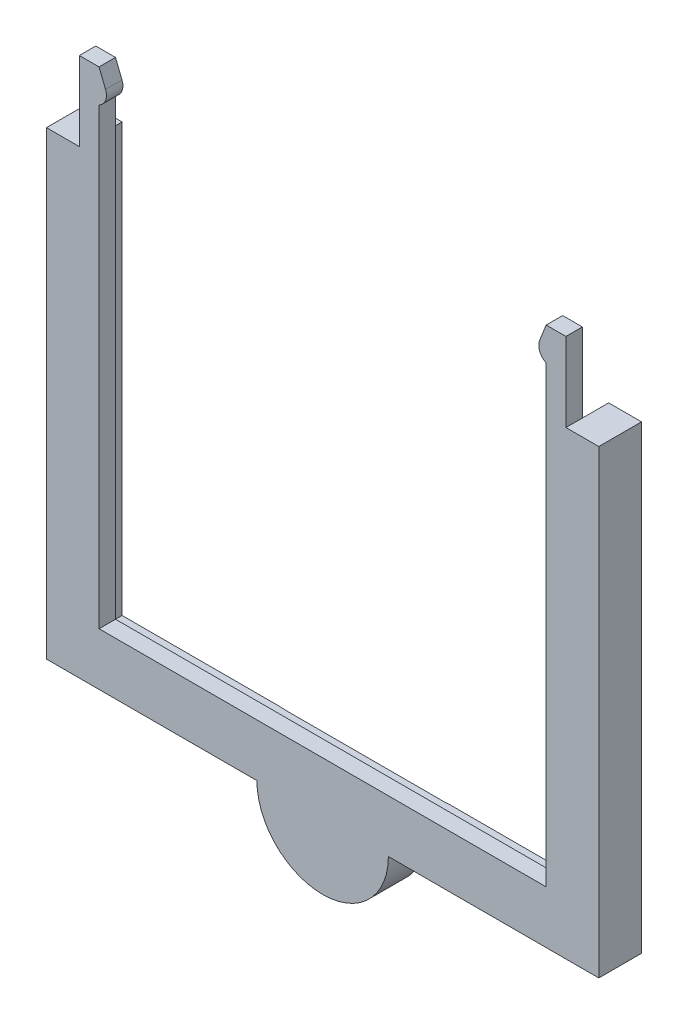
ISO-10303-21;
HEADER;
FILE_DESCRIPTION(('STEP AP214'),'2;1');
FILE_NAME('part.step','',(''),(''),'','','');
FILE_SCHEMA(('AUTOMOTIVE_DESIGN { 1 0 10303 214 1 1 1 1 }'));
ENDSEC;
DATA;
#1=APPLICATION_CONTEXT('core data for automotive mechanical design processes');
#2=APPLICATION_PROTOCOL_DEFINITION('international standard','automotive_design',2000,#1);
#3=PRODUCT_CONTEXT('',#1,'mechanical');
#4=PRODUCT('Part','Part','',(#3));
#5=PRODUCT_RELATED_PRODUCT_CATEGORY('part','',(#4));
#6=PRODUCT_DEFINITION_FORMATION('','',#4);
#7=PRODUCT_DEFINITION_CONTEXT('part definition',#1,'design');
#8=PRODUCT_DEFINITION('design','',#6,#7);
#9=PRODUCT_DEFINITION_SHAPE('','',#8);
#10=(LENGTH_UNIT() NAMED_UNIT(*) SI_UNIT(.MILLI.,.METRE.));
#11=(NAMED_UNIT(*) PLANE_ANGLE_UNIT() SI_UNIT($,.RADIAN.));
#12=(NAMED_UNIT(*) SI_UNIT($,.STERADIAN.) SOLID_ANGLE_UNIT());
#13=UNCERTAINTY_MEASURE_WITH_UNIT(LENGTH_MEASURE(1.E-05),#10,'distance_accuracy_value','');
#14=(GEOMETRIC_REPRESENTATION_CONTEXT(3) GLOBAL_UNCERTAINTY_ASSIGNED_CONTEXT((#13)) GLOBAL_UNIT_ASSIGNED_CONTEXT((#10,
#11,#12)) REPRESENTATION_CONTEXT('',''));
#15=CARTESIAN_POINT('',(0.,0.,0.));
#16=DIRECTION('',(0.,0.,1.));
#17=DIRECTION('',(1.,0.,0.));
#18=AXIS2_PLACEMENT_3D('',#15,#16,#17);
#19=CARTESIAN_POINT('',(-42.,0.,-4.));
#20=DIRECTION('',(0.,0.,-1.));
#21=DIRECTION('',(-1.,0.,0.));
#22=AXIS2_PLACEMENT_3D('',#19,#20,#21);
#23=PLANE('',#22);
#24=DIRECTION('',(1.,0.,0.));
#25=VECTOR('',#24,1.);
#26=CARTESIAN_POINT('',(-79.,5.,-4.));
#27=LINE('',#26,#25);
#28=CARTESIAN_POINT('',(-79.,5.,-4.));
#29=VERTEX_POINT('',#28);
#30=CARTESIAN_POINT('',(-55.076696830622,5.,-4.));
#31=VERTEX_POINT('',#30);
#32=EDGE_CURVE('E244',#29,#31,#27,.T.);
#33=ORIENTED_EDGE('',*,*,#32,.T.);
#34=CARTESIAN_POINT('',(-42.,0.,-4.));
#35=DIRECTION('',(0.,0.,-1.));
#36=DIRECTION('',(-1.,0.,0.));
#37=AXIS2_PLACEMENT_3D('',#34,#35,#36);
#38=CIRCLE('',#37,14.);
#39=CARTESIAN_POINT('',(-56.,0.,-4.));
#40=VERTEX_POINT('',#39);
#41=EDGE_CURVE('E483',#31,#40,#38,.F.);
#42=ORIENTED_EDGE('',*,*,#41,.T.);
#43=DIRECTION('',(-1.,0.,0.));
#44=VECTOR('',#43,1.);
#45=CARTESIAN_POINT('',(0.,0.,-4.));
#46=LINE('',#45,#44);
#47=CARTESIAN_POINT('',(-84.,0.,-4.));
#48=VERTEX_POINT('',#47);
#49=EDGE_CURVE('E231',#40,#48,#46,.T.);
#50=ORIENTED_EDGE('',*,*,#49,.T.);
#51=DIRECTION('',(0.,1.,0.));
#52=VECTOR('',#51,1.);
#53=CARTESIAN_POINT('',(-84.,0.,-4.));
#54=LINE('',#53,#52);
#55=CARTESIAN_POINT('',(-84.,70.,-4.));
#56=VERTEX_POINT('',#55);
#57=EDGE_CURVE('E236',#48,#56,#54,.T.);
#58=ORIENTED_EDGE('',*,*,#57,.T.);
#59=DIRECTION('',(1.,0.,0.));
#60=VECTOR('',#59,1.);
#61=CARTESIAN_POINT('',(-84.,70.,-4.));
#62=LINE('',#61,#60);
#63=CARTESIAN_POINT('',(-79.,70.,-4.));
#64=VERTEX_POINT('',#63);
#65=EDGE_CURVE('E239',#56,#64,#62,.T.);
#66=ORIENTED_EDGE('',*,*,#65,.T.);
#67=DIRECTION('',(0.,-1.,0.));
#68=VECTOR('',#67,1.);
#69=CARTESIAN_POINT('',(-79.,70.,-4.));
#70=LINE('',#69,#68);
#71=EDGE_CURVE('E241',#64,#29,#70,.T.);
#72=ORIENTED_EDGE('',*,*,#71,.T.);
#73=EDGE_LOOP('',(#33,#42,#50,#58,#66,#72));
#74=FACE_BOUND('',#73,.T.);
#75=ADVANCED_FACE('F33',(#74),#23,.T.);
#76=CARTESIAN_POINT('',(0.,0.,0.));
#77=DIRECTION('',(0.,0.,1.));
#78=DIRECTION('',(1.,0.,0.));
#79=AXIS2_PLACEMENT_3D('',#76,#77,#78);
#80=PLANE('',#79);
#81=DIRECTION('',(0.,-1.,0.));
#82=VECTOR('',#81,1.);
#83=CARTESIAN_POINT('',(-8.,7.99999999999999,0.));
#84=LINE('',#83,#82);
#85=CARTESIAN_POINT('',(-8.,77.,0.));
#86=VERTEX_POINT('',#85);
#87=CARTESIAN_POINT('',(-8.,7.99999999999999,0.));
#88=VERTEX_POINT('',#87);
#89=EDGE_CURVE('E325',#86,#88,#84,.T.);
#90=ORIENTED_EDGE('',*,*,#89,.F.);
#91=CARTESIAN_POINT('',(-7.12630551264708,78.7990714112478,0.));
#92=DIRECTION('',(0.,0.,1.));
#93=DIRECTION('',(1.,0.,0.));
#94=AXIS2_PLACEMENT_3D('',#91,#92,#93);
#95=CIRCLE('',#94,2.);
#96=CARTESIAN_POINT('',(-8.9832588944176,79.541852763956,0.));
#97=VERTEX_POINT('',#96);
#98=EDGE_CURVE('E529',#86,#97,#95,.F.);
#99=ORIENTED_EDGE('',*,*,#98,.T.);
#100=DIRECTION('',(0.371390676354103,0.928476690885259,0.));
#101=VECTOR('',#100,1.);
#102=CARTESIAN_POINT('',(-8.,82.,0.));
#103=LINE('',#102,#101);
#104=CARTESIAN_POINT('',(-8.,82.,0.));
#105=VERTEX_POINT('',#104);
#106=EDGE_CURVE('E280',#97,#105,#103,.T.);
#107=ORIENTED_EDGE('',*,*,#106,.T.);
#108=DIRECTION('',(-1.,0.,0.));
#109=VECTOR('',#108,1.);
#110=CARTESIAN_POINT('',(-8.,82.,0.));
#111=LINE('',#110,#109);
#112=CARTESIAN_POINT('',(-5.,82.,0.));
#113=VERTEX_POINT('',#112);
#114=EDGE_CURVE('E314',#113,#105,#111,.T.);
#115=ORIENTED_EDGE('',*,*,#114,.F.);
#116=DIRECTION('',(0.,-1.,0.));
#117=VECTOR('',#116,1.);
#118=CARTESIAN_POINT('',(-5.,82.,0.));
#119=LINE('',#118,#117);
#120=CARTESIAN_POINT('',(-5.,70.,0.));
#121=VERTEX_POINT('',#120);
#122=EDGE_CURVE('E317',#113,#121,#119,.T.);
#123=ORIENTED_EDGE('',*,*,#122,.T.);
#124=DIRECTION('',(0.,1.,0.));
#125=VECTOR('',#124,1.);
#126=CARTESIAN_POINT('',(-5.,4.99999999999999,0.));
#127=LINE('',#126,#125);
#128=CARTESIAN_POINT('',(-5.,4.99999999999999,0.));
#129=VERTEX_POINT('',#128);
#130=EDGE_CURVE('E232',#129,#121,#127,.T.);
#131=ORIENTED_EDGE('',*,*,#130,.F.);
#132=DIRECTION('',(1.,0.,0.));
#133=VECTOR('',#132,1.);
#134=CARTESIAN_POINT('',(-79.,5.,0.));
#135=LINE('',#134,#133);
#136=CARTESIAN_POINT('',(-79.,5.,0.));
#137=VERTEX_POINT('',#136);
#138=EDGE_CURVE('E225',#137,#129,#135,.T.);
#139=ORIENTED_EDGE('',*,*,#138,.F.);
#140=DIRECTION('',(0.,-1.,0.));
#141=VECTOR('',#140,1.);
#142=CARTESIAN_POINT('',(-79.,70.,0.));
#143=LINE('',#142,#141);
#144=CARTESIAN_POINT('',(-79.,70.,0.));
#145=VERTEX_POINT('',#144);
#146=EDGE_CURVE('E223',#145,#137,#143,.T.);
#147=ORIENTED_EDGE('',*,*,#146,.F.);
#148=DIRECTION('',(0.,-1.,0.));
#149=VECTOR('',#148,1.);
#150=CARTESIAN_POINT('',(-79.,82.,0.));
#151=LINE('',#150,#149);
#152=CARTESIAN_POINT('',(-79.,82.,0.));
#153=VERTEX_POINT('',#152);
#154=EDGE_CURVE('E303',#153,#145,#151,.T.);
#155=ORIENTED_EDGE('',*,*,#154,.F.);
#156=DIRECTION('',(-1.,0.,0.));
#157=VECTOR('',#156,1.);
#158=CARTESIAN_POINT('',(-76.,82.,0.));
#159=LINE('',#158,#157);
#160=CARTESIAN_POINT('',(-76.,82.,0.));
#161=VERTEX_POINT('',#160);
#162=EDGE_CURVE('E291',#161,#153,#159,.T.);
#163=ORIENTED_EDGE('',*,*,#162,.F.);
#164=DIRECTION('',(0.371390676354108,-0.928476690885258,0.));
#165=VECTOR('',#164,1.);
#166=CARTESIAN_POINT('',(-74.,77.,0.));
#167=LINE('',#166,#165);
#168=CARTESIAN_POINT('',(-75.0167411055824,79.541852763956,0.));
#169=VERTEX_POINT('',#168);
#170=EDGE_CURVE('E272',#161,#169,#167,.T.);
#171=ORIENTED_EDGE('',*,*,#170,.T.);
#172=CARTESIAN_POINT('',(-76.8736944873529,78.7990714112478,0.));
#173=DIRECTION('',(0.,0.,1.));
#174=DIRECTION('',(1.,0.,0.));
#175=AXIS2_PLACEMENT_3D('',#172,#173,#174);
#176=CIRCLE('',#175,2.);
#177=CARTESIAN_POINT('',(-76.,77.,0.));
#178=VERTEX_POINT('',#177);
#179=EDGE_CURVE('E528',#169,#178,#176,.F.);
#180=ORIENTED_EDGE('',*,*,#179,.T.);
#181=DIRECTION('',(0.,1.,0.));
#182=VECTOR('',#181,1.);
#183=CARTESIAN_POINT('',(-76.,70.,0.));
#184=LINE('',#183,#182);
#185=CARTESIAN_POINT('',(-76.,7.99999999999999,0.));
#186=VERTEX_POINT('',#185);
#187=EDGE_CURVE('E330',#186,#178,#184,.T.);
#188=ORIENTED_EDGE('',*,*,#187,.F.);
#189=DIRECTION('',(-1.,0.,0.));
#190=VECTOR('',#189,1.);
#191=CARTESIAN_POINT('',(-76.,7.99999999999999,0.));
#192=LINE('',#191,#190);
#193=EDGE_CURVE('E349',#88,#186,#192,.T.);
#194=ORIENTED_EDGE('',*,*,#193,.F.);
#195=EDGE_LOOP('',(#90,#99,#107,#115,#123,#131,#139,#147,#155,#163,#171,#180,#188,#194));
#196=FACE_BOUND('',#195,.T.);
#197=ADVANCED_FACE('F431',(#196),#80,.F.);
#198=CARTESIAN_POINT('',(0.,0.,2.5));
#199=DIRECTION('',(0.,1.,0.));
#200=DIRECTION('',(-1.,0.,0.));
#201=AXIS2_PLACEMENT_3D('',#198,#199,#200);
#202=PLANE('',#201);
#203=ORIENTED_EDGE('',*,*,#49,.F.);
#204=CARTESIAN_POINT('',(-56.,0.,6.));
#205=DIRECTION('',(0.,1.,0.));
#206=DIRECTION('',(-1.,0.,0.));
#207=AXIS2_PLACEMENT_3D('',#204,#205,#206);
#208=CIRCLE('',#207,10.);
#209=CARTESIAN_POINT('',(-52.,0.,-3.16515138991168));
#210=VERTEX_POINT('',#209);
#211=EDGE_CURVE('E481',#40,#210,#208,.F.);
#212=ORIENTED_EDGE('',*,*,#211,.T.);
#213=DIRECTION('',(0.,0.,1.));
#214=VECTOR('',#213,1.);
#215=CARTESIAN_POINT('',(-52.,0.,-4.));
#216=LINE('',#215,#214);
#217=CARTESIAN_POINT('',(-52.,0.,2.5));
#218=VERTEX_POINT('',#217);
#219=EDGE_CURVE('E270',#210,#218,#216,.T.);
#220=ORIENTED_EDGE('',*,*,#219,.T.);
#221=DIRECTION('',(1.,0.,0.));
#222=VECTOR('',#221,1.);
#223=CARTESIAN_POINT('',(0.,0.,2.5));
#224=LINE('',#223,#222);
#225=CARTESIAN_POINT('',(-84.,0.,2.5));
#226=VERTEX_POINT('',#225);
#227=EDGE_CURVE('E344',#226,#218,#224,.T.);
#228=ORIENTED_EDGE('',*,*,#227,.F.);
#229=DIRECTION('',(0.,0.,-1.));
#230=VECTOR('',#229,1.);
#231=CARTESIAN_POINT('',(-84.,0.,2.5));
#232=LINE('',#231,#230);
#233=EDGE_CURVE('E354',#226,#48,#232,.T.);
#234=ORIENTED_EDGE('',*,*,#233,.T.);
#235=EDGE_LOOP('',(#203,#212,#220,#228,#234));
#236=FACE_BOUND('',#235,.T.);
#237=ADVANCED_FACE('F434',(#236),#202,.F.);
#238=DIRECTION('',(0.,0.,1.));
#239=VECTOR('',#238,1.);
#240=CARTESIAN_POINT('',(-32.,0.,-4.));
#241=LINE('',#240,#239);
#242=CARTESIAN_POINT('',(-32.,0.,-3.16515138991168));
#243=VERTEX_POINT('',#242);
#244=CARTESIAN_POINT('',(-32.,0.,2.5));
#245=VERTEX_POINT('',#244);
#246=EDGE_CURVE('E268',#243,#245,#241,.T.);
#247=ORIENTED_EDGE('',*,*,#246,.F.);
#248=CARTESIAN_POINT('',(-28.,0.,6.));
#249=DIRECTION('',(0.,1.,0.));
#250=DIRECTION('',(-1.,0.,0.));
#251=AXIS2_PLACEMENT_3D('',#248,#249,#250);
#252=CIRCLE('',#251,10.);
#253=CARTESIAN_POINT('',(-28.,0.,-4.));
#254=VERTEX_POINT('',#253);
#255=EDGE_CURVE('E215',#243,#254,#252,.F.);
#256=ORIENTED_EDGE('',*,*,#255,.T.);
#257=CARTESIAN_POINT('',(0.,0.,-4.));
#258=VERTEX_POINT('',#257);
#259=EDGE_CURVE('E233',#258,#254,#46,.T.);
#260=ORIENTED_EDGE('',*,*,#259,.F.);
#261=DIRECTION('',(0.,0.,-1.));
#262=VECTOR('',#261,1.);
#263=CARTESIAN_POINT('',(0.,0.,2.5));
#264=LINE('',#263,#262);
#265=CARTESIAN_POINT('',(0.,0.,2.5));
#266=VERTEX_POINT('',#265);
#267=EDGE_CURVE('E347',#266,#258,#264,.T.);
#268=ORIENTED_EDGE('',*,*,#267,.F.);
#269=EDGE_CURVE('E343',#245,#266,#224,.T.);
#270=ORIENTED_EDGE('',*,*,#269,.F.);
#271=EDGE_LOOP('',(#247,#256,#260,#268,#270));
#272=FACE_BOUND('',#271,.T.);
#273=ADVANCED_FACE('F438',(#272),#202,.F.);
#274=CARTESIAN_POINT('',(-76.,70.,2.5));
#275=DIRECTION('',(0.,-1.,0.));
#276=DIRECTION('',(0.,0.,-1.));
#277=AXIS2_PLACEMENT_3D('',#274,#275,#276);
#278=PLANE('',#277);
#279=DIRECTION('',(0.,0.,1.));
#280=VECTOR('',#279,1.);
#281=CARTESIAN_POINT('',(-79.,70.,2.5));
#282=LINE('',#281,#280);
#283=CARTESIAN_POINT('',(-79.,70.,2.5));
#284=VERTEX_POINT('',#283);
#285=EDGE_CURVE('E287',#145,#284,#282,.T.);
#286=ORIENTED_EDGE('',*,*,#285,.F.);
#287=DIRECTION('',(0.,0.,1.));
#288=VECTOR('',#287,1.);
#289=CARTESIAN_POINT('',(-79.,70.,-4.));
#290=LINE('',#289,#288);
#291=EDGE_CURVE('E263',#64,#145,#290,.T.);
#292=ORIENTED_EDGE('',*,*,#291,.F.);
#293=ORIENTED_EDGE('',*,*,#65,.F.);
#294=DIRECTION('',(0.,0.,-1.));
#295=VECTOR('',#294,1.);
#296=CARTESIAN_POINT('',(-84.,70.,2.5));
#297=LINE('',#296,#295);
#298=CARTESIAN_POINT('',(-84.,70.,2.5));
#299=VERTEX_POINT('',#298);
#300=EDGE_CURVE('E357',#299,#56,#297,.T.);
#301=ORIENTED_EDGE('',*,*,#300,.F.);
#302=DIRECTION('',(-1.,0.,0.));
#303=VECTOR('',#302,1.);
#304=CARTESIAN_POINT('',(-76.,70.,2.5));
#305=LINE('',#304,#303);
#306=EDGE_CURVE('E339',#284,#299,#305,.T.);
#307=ORIENTED_EDGE('',*,*,#306,.F.);
#308=EDGE_LOOP('',(#286,#292,#293,#301,#307));
#309=FACE_BOUND('',#308,.T.);
#310=ADVANCED_FACE('F444',(#309),#278,.F.);
#311=CARTESIAN_POINT('',(0.,70.,2.5));
#312=DIRECTION('',(0.,-1.,0.));
#313=DIRECTION('',(0.,0.,-1.));
#314=AXIS2_PLACEMENT_3D('',#311,#312,#313);
#315=PLANE('',#314);
#316=DIRECTION('',(0.,0.,-1.));
#317=VECTOR('',#316,1.);
#318=CARTESIAN_POINT('',(-5.,70.,2.5));
#319=LINE('',#318,#317);
#320=CARTESIAN_POINT('',(-5.,70.,2.5));
#321=VERTEX_POINT('',#320);
#322=EDGE_CURVE('E306',#321,#121,#319,.T.);
#323=ORIENTED_EDGE('',*,*,#322,.F.);
#324=DIRECTION('',(-1.,0.,0.));
#325=VECTOR('',#324,1.);
#326=CARTESIAN_POINT('',(0.,70.,2.5));
#327=LINE('',#326,#325);
#328=CARTESIAN_POINT('',(0.,70.,2.5));
#329=VERTEX_POINT('',#328);
#330=EDGE_CURVE('E329',#329,#321,#327,.T.);
#331=ORIENTED_EDGE('',*,*,#330,.F.);
#332=DIRECTION('',(0.,0.,-1.));
#333=VECTOR('',#332,1.);
#334=CARTESIAN_POINT('',(0.,70.,2.5));
#335=LINE('',#334,#333);
#336=CARTESIAN_POINT('',(0.,70.,-4.));
#337=VERTEX_POINT('',#336);
#338=EDGE_CURVE('E365',#329,#337,#335,.T.);
#339=ORIENTED_EDGE('',*,*,#338,.T.);
#340=DIRECTION('',(1.,0.,0.));
#341=VECTOR('',#340,1.);
#342=CARTESIAN_POINT('',(-5.,70.,-4.));
#343=LINE('',#342,#341);
#344=CARTESIAN_POINT('',(-5.,70.,-4.));
#345=VERTEX_POINT('',#344);
#346=EDGE_CURVE('E249',#345,#337,#343,.T.);
#347=ORIENTED_EDGE('',*,*,#346,.F.);
#348=DIRECTION('',(0.,0.,1.));
#349=VECTOR('',#348,1.);
#350=CARTESIAN_POINT('',(-5.,70.,-4.));
#351=LINE('',#350,#349);
#352=EDGE_CURVE('E251',#345,#121,#351,.T.);
#353=ORIENTED_EDGE('',*,*,#352,.T.);
#354=EDGE_LOOP('',(#323,#331,#339,#347,#353));
#355=FACE_BOUND('',#354,.T.);
#356=ADVANCED_FACE('F447',(#355),#315,.F.);
#357=CARTESIAN_POINT('',(0.,0.,2.5));
#358=DIRECTION('',(-1.,0.,0.));
#359=DIRECTION('',(0.,-1.,0.));
#360=AXIS2_PLACEMENT_3D('',#357,#358,#359);
#361=PLANE('',#360);
#362=ORIENTED_EDGE('',*,*,#267,.T.);
#363=DIRECTION('',(0.,-1.,0.));
#364=VECTOR('',#363,1.);
#365=CARTESIAN_POINT('',(0.,69.7761556366174,-4.));
#366=LINE('',#365,#364);
#367=EDGE_CURVE('E228',#337,#258,#366,.T.);
#368=ORIENTED_EDGE('',*,*,#367,.F.);
#369=ORIENTED_EDGE('',*,*,#338,.F.);
#370=DIRECTION('',(0.,1.,0.));
#371=VECTOR('',#370,1.);
#372=CARTESIAN_POINT('',(0.,0.,2.5));
#373=LINE('',#372,#371);
#374=EDGE_CURVE('E326',#266,#329,#373,.T.);
#375=ORIENTED_EDGE('',*,*,#374,.F.);
#376=EDGE_LOOP('',(#362,#368,#369,#375));
#377=FACE_BOUND('',#376,.T.);
#378=ADVANCED_FACE('F459',(#377),#361,.F.);
#379=CARTESIAN_POINT('',(-8.,7.99999999999999,2.5));
#380=DIRECTION('',(1.,0.,0.));
#381=DIRECTION('',(0.,0.,-1.));
#382=AXIS2_PLACEMENT_3D('',#379,#380,#381);
#383=PLANE('',#382);
#384=DIRECTION('',(0.,-1.,0.));
#385=VECTOR('',#384,1.);
#386=CARTESIAN_POINT('',(-8.,7.99999999999999,2.5));
#387=LINE('',#386,#385);
#388=CARTESIAN_POINT('',(-8.,77.,2.5));
#389=VERTEX_POINT('',#388);
#390=CARTESIAN_POINT('',(-8.,7.99999999999999,2.5));
#391=VERTEX_POINT('',#390);
#392=EDGE_CURVE('E333',#389,#391,#387,.T.);
#393=ORIENTED_EDGE('',*,*,#392,.F.);
#394=DIRECTION('',(0.,0.,-1.));
#395=VECTOR('',#394,1.);
#396=CARTESIAN_POINT('',(-8.,77.,2.5));
#397=LINE('',#396,#395);
#398=EDGE_CURVE('E283',#389,#86,#397,.T.);
#399=ORIENTED_EDGE('',*,*,#398,.T.);
#400=ORIENTED_EDGE('',*,*,#89,.T.);
#401=DIRECTION('',(0.,0.,-1.));
#402=VECTOR('',#401,1.);
#403=CARTESIAN_POINT('',(-8.,7.99999999999999,2.5));
#404=LINE('',#403,#402);
#405=EDGE_CURVE('E362',#391,#88,#404,.T.);
#406=ORIENTED_EDGE('',*,*,#405,.F.);
#407=EDGE_LOOP('',(#393,#399,#400,#406));
#408=FACE_BOUND('',#407,.T.);
#409=ADVANCED_FACE('F455',(#408),#383,.F.);
#410=CARTESIAN_POINT('',(-76.,7.99999999999999,2.5));
#411=DIRECTION('',(0.,-1.,0.));
#412=DIRECTION('',(1.,0.,0.));
#413=AXIS2_PLACEMENT_3D('',#410,#411,#412);
#414=PLANE('',#413);
#415=ORIENTED_EDGE('',*,*,#193,.T.);
#416=DIRECTION('',(0.,0.,-1.));
#417=VECTOR('',#416,1.);
#418=CARTESIAN_POINT('',(-76.,7.99999999999999,2.5));
#419=LINE('',#418,#417);
#420=CARTESIAN_POINT('',(-76.,7.99999999999999,2.5));
#421=VERTEX_POINT('',#420);
#422=EDGE_CURVE('E359',#421,#186,#419,.T.);
#423=ORIENTED_EDGE('',*,*,#422,.F.);
#424=DIRECTION('',(-1.,0.,0.));
#425=VECTOR('',#424,1.);
#426=CARTESIAN_POINT('',(-76.,7.99999999999999,2.5));
#427=LINE('',#426,#425);
#428=EDGE_CURVE('E335',#391,#421,#427,.T.);
#429=ORIENTED_EDGE('',*,*,#428,.F.);
#430=ORIENTED_EDGE('',*,*,#405,.T.);
#431=EDGE_LOOP('',(#415,#423,#429,#430));
#432=FACE_BOUND('',#431,.T.);
#433=ADVANCED_FACE('F451',(#432),#414,.F.);
#434=CARTESIAN_POINT('',(-76.,70.,2.5));
#435=DIRECTION('',(-1.,0.,0.));
#436=DIRECTION('',(0.,-1.,0.));
#437=AXIS2_PLACEMENT_3D('',#434,#435,#436);
#438=PLANE('',#437);
#439=ORIENTED_EDGE('',*,*,#187,.T.);
#440=DIRECTION('',(0.,0.,-1.));
#441=VECTOR('',#440,1.);
#442=CARTESIAN_POINT('',(-76.,77.,2.5));
#443=LINE('',#442,#441);
#444=CARTESIAN_POINT('',(-76.,77.,2.5));
#445=VERTEX_POINT('',#444);
#446=EDGE_CURVE('E275',#445,#178,#443,.T.);
#447=ORIENTED_EDGE('',*,*,#446,.F.);
#448=DIRECTION('',(0.,1.,0.));
#449=VECTOR('',#448,1.);
#450=CARTESIAN_POINT('',(-76.,70.,2.5));
#451=LINE('',#450,#449);
#452=EDGE_CURVE('E337',#421,#445,#451,.T.);
#453=ORIENTED_EDGE('',*,*,#452,.F.);
#454=ORIENTED_EDGE('',*,*,#422,.T.);
#455=EDGE_LOOP('',(#439,#447,#453,#454));
#456=FACE_BOUND('',#455,.T.);
#457=ADVANCED_FACE('F442',(#456),#438,.F.);
#458=CARTESIAN_POINT('',(-84.,0.,2.5));
#459=DIRECTION('',(1.,0.,0.));
#460=DIRECTION('',(0.,0.,-1.));
#461=AXIS2_PLACEMENT_3D('',#458,#459,#460);
#462=PLANE('',#461);
#463=ORIENTED_EDGE('',*,*,#300,.T.);
#464=ORIENTED_EDGE('',*,*,#57,.F.);
#465=ORIENTED_EDGE('',*,*,#233,.F.);
#466=DIRECTION('',(0.,-1.,0.));
#467=VECTOR('',#466,1.);
#468=CARTESIAN_POINT('',(-84.,0.,2.5));
#469=LINE('',#468,#467);
#470=EDGE_CURVE('E341',#299,#226,#469,.T.);
#471=ORIENTED_EDGE('',*,*,#470,.F.);
#472=EDGE_LOOP('',(#463,#464,#465,#471));
#473=FACE_BOUND('',#472,.T.);
#474=ADVANCED_FACE('F430',(#473),#462,.F.);
#475=CARTESIAN_POINT('',(0.,0.,2.5));
#476=DIRECTION('',(0.,0.,1.));
#477=DIRECTION('',(1.,0.,0.));
#478=AXIS2_PLACEMENT_3D('',#475,#476,#477);
#479=PLANE('',#478);
#480=DIRECTION('',(0.371390676354103,0.928476690885259,0.));
#481=VECTOR('',#480,1.);
#482=CARTESIAN_POINT('',(-8.,82.,2.5));
#483=LINE('',#482,#481);
#484=CARTESIAN_POINT('',(-8.9832588944176,79.541852763956,2.5));
#485=VERTEX_POINT('',#484);
#486=CARTESIAN_POINT('',(-8.,82.,2.5));
#487=VERTEX_POINT('',#486);
#488=EDGE_CURVE('E281',#485,#487,#483,.T.);
#489=ORIENTED_EDGE('',*,*,#488,.F.);
#490=CARTESIAN_POINT('',(-7.12630551264708,78.7990714112478,2.5));
#491=DIRECTION('',(0.,0.,1.));
#492=DIRECTION('',(1.,0.,0.));
#493=AXIS2_PLACEMENT_3D('',#490,#491,#492);
#494=CIRCLE('',#493,2.);
#495=EDGE_CURVE('E41',#485,#389,#494,.T.);
#496=ORIENTED_EDGE('',*,*,#495,.T.);
#497=ORIENTED_EDGE('',*,*,#392,.T.);
#498=ORIENTED_EDGE('',*,*,#428,.T.);
#499=ORIENTED_EDGE('',*,*,#452,.T.);
#500=CARTESIAN_POINT('',(-76.8736944873529,78.7990714112478,2.5));
#501=DIRECTION('',(0.,0.,1.));
#502=DIRECTION('',(1.,0.,0.));
#503=AXIS2_PLACEMENT_3D('',#500,#501,#502);
#504=CIRCLE('',#503,2.);
#505=CARTESIAN_POINT('',(-75.0167411055824,79.541852763956,2.5));
#506=VERTEX_POINT('',#505);
#507=EDGE_CURVE('E48',#445,#506,#504,.T.);
#508=ORIENTED_EDGE('',*,*,#507,.T.);
#509=DIRECTION('',(0.371390676354108,-0.928476690885258,0.));
#510=VECTOR('',#509,1.);
#511=CARTESIAN_POINT('',(-74.,77.,2.5));
#512=LINE('',#511,#510);
#513=CARTESIAN_POINT('',(-76.,82.,2.5));
#514=VERTEX_POINT('',#513);
#515=EDGE_CURVE('E273',#514,#506,#512,.T.);
#516=ORIENTED_EDGE('',*,*,#515,.F.);
#517=DIRECTION('',(1.,0.,0.));
#518=VECTOR('',#517,1.);
#519=CARTESIAN_POINT('',(-76.,82.,2.5));
#520=LINE('',#519,#518);
#521=CARTESIAN_POINT('',(-79.,82.,2.5));
#522=VERTEX_POINT('',#521);
#523=EDGE_CURVE('E295',#522,#514,#520,.T.);
#524=ORIENTED_EDGE('',*,*,#523,.F.);
#525=DIRECTION('',(0.,-1.,0.));
#526=VECTOR('',#525,1.);
#527=CARTESIAN_POINT('',(-79.,82.,2.5));
#528=LINE('',#527,#526);
#529=EDGE_CURVE('E298',#522,#284,#528,.T.);
#530=ORIENTED_EDGE('',*,*,#529,.T.);
#531=ORIENTED_EDGE('',*,*,#306,.T.);
#532=ORIENTED_EDGE('',*,*,#470,.T.);
#533=ORIENTED_EDGE('',*,*,#227,.T.);
#534=CARTESIAN_POINT('',(-42.,0.,2.5));
#535=DIRECTION('',(0.,0.,-1.));
#536=DIRECTION('',(-1.,0.,0.));
#537=AXIS2_PLACEMENT_3D('',#534,#535,#536);
#538=CIRCLE('',#537,10.);
#539=EDGE_CURVE('E265',#245,#218,#538,.T.);
#540=ORIENTED_EDGE('',*,*,#539,.F.);
#541=ORIENTED_EDGE('',*,*,#269,.T.);
#542=ORIENTED_EDGE('',*,*,#374,.T.);
#543=ORIENTED_EDGE('',*,*,#330,.T.);
#544=DIRECTION('',(0.,-1.,0.));
#545=VECTOR('',#544,1.);
#546=CARTESIAN_POINT('',(-5.,82.,2.5));
#547=LINE('',#546,#545);
#548=CARTESIAN_POINT('',(-5.,82.,2.5));
#549=VERTEX_POINT('',#548);
#550=EDGE_CURVE('E322',#549,#321,#547,.T.);
#551=ORIENTED_EDGE('',*,*,#550,.F.);
#552=DIRECTION('',(1.,0.,0.));
#553=VECTOR('',#552,1.);
#554=CARTESIAN_POINT('',(-8.,82.,2.5));
#555=LINE('',#554,#553);
#556=EDGE_CURVE('E310',#487,#549,#555,.T.);
#557=ORIENTED_EDGE('',*,*,#556,.F.);
#558=EDGE_LOOP('',(#489,#496,#497,#498,#499,#508,#516,#524,#530,#531,#532,#533,#540,#541,#542,
#543,#551,#557));
#559=FACE_BOUND('',#558,.T.);
#560=ADVANCED_FACE('F426',(#559),#479,.T.);
#561=CARTESIAN_POINT('',(-5.,82.,2.5));
#562=DIRECTION('',(-1.,0.,0.));
#563=DIRECTION('',(0.,0.,1.));
#564=AXIS2_PLACEMENT_3D('',#561,#562,#563);
#565=PLANE('',#564);
#566=ORIENTED_EDGE('',*,*,#322,.T.);
#567=ORIENTED_EDGE('',*,*,#122,.F.);
#568=DIRECTION('',(0.,0.,-1.));
#569=VECTOR('',#568,1.);
#570=CARTESIAN_POINT('',(-5.,82.,2.5));
#571=LINE('',#570,#569);
#572=EDGE_CURVE('E312',#549,#113,#571,.T.);
#573=ORIENTED_EDGE('',*,*,#572,.F.);
#574=ORIENTED_EDGE('',*,*,#550,.T.);
#575=EDGE_LOOP('',(#566,#567,#573,#574));
#576=FACE_BOUND('',#575,.T.);
#577=ADVANCED_FACE('F422',(#576),#565,.F.);
#578=CARTESIAN_POINT('',(0.,82.,0.));
#579=DIRECTION('',(0.,-1.,0.));
#580=DIRECTION('',(0.,0.,-1.));
#581=AXIS2_PLACEMENT_3D('',#578,#579,#580);
#582=PLANE('',#581);
#583=DIRECTION('',(0.,0.,1.));
#584=VECTOR('',#583,1.);
#585=CARTESIAN_POINT('',(-8.,82.,2.5));
#586=LINE('',#585,#584);
#587=EDGE_CURVE('E307',#105,#487,#586,.T.);
#588=ORIENTED_EDGE('',*,*,#587,.T.);
#589=ORIENTED_EDGE('',*,*,#556,.T.);
#590=ORIENTED_EDGE('',*,*,#572,.T.);
#591=ORIENTED_EDGE('',*,*,#114,.T.);
#592=EDGE_LOOP('',(#588,#589,#590,#591));
#593=FACE_BOUND('',#592,.T.);
#594=ADVANCED_FACE('F418',(#593),#582,.F.);
#595=CARTESIAN_POINT('',(-79.,82.,2.5));
#596=DIRECTION('',(1.,0.,0.));
#597=DIRECTION('',(0.,0.,-1.));
#598=AXIS2_PLACEMENT_3D('',#595,#596,#597);
#599=PLANE('',#598);
#600=ORIENTED_EDGE('',*,*,#285,.T.);
#601=ORIENTED_EDGE('',*,*,#529,.F.);
#602=DIRECTION('',(0.,0.,1.));
#603=VECTOR('',#602,1.);
#604=CARTESIAN_POINT('',(-79.,82.,2.5));
#605=LINE('',#604,#603);
#606=EDGE_CURVE('E293',#153,#522,#605,.T.);
#607=ORIENTED_EDGE('',*,*,#606,.F.);
#608=ORIENTED_EDGE('',*,*,#154,.T.);
#609=EDGE_LOOP('',(#600,#601,#607,#608));
#610=FACE_BOUND('',#609,.T.);
#611=ADVANCED_FACE('F414',(#610),#599,.F.);
#612=CARTESIAN_POINT('',(0.,82.,0.));
#613=DIRECTION('',(0.,1.,0.));
#614=DIRECTION('',(0.,0.,1.));
#615=AXIS2_PLACEMENT_3D('',#612,#613,#614);
#616=PLANE('',#615);
#617=DIRECTION('',(0.,0.,-1.));
#618=VECTOR('',#617,1.);
#619=CARTESIAN_POINT('',(-76.,82.,2.5));
#620=LINE('',#619,#618);
#621=EDGE_CURVE('E288',#514,#161,#620,.T.);
#622=ORIENTED_EDGE('',*,*,#621,.T.);
#623=ORIENTED_EDGE('',*,*,#162,.T.);
#624=ORIENTED_EDGE('',*,*,#606,.T.);
#625=ORIENTED_EDGE('',*,*,#523,.T.);
#626=EDGE_LOOP('',(#622,#623,#624,#625));
#627=FACE_BOUND('',#626,.T.);
#628=ADVANCED_FACE('F411',(#627),#616,.T.);
#629=CARTESIAN_POINT('',(-8.,82.,2.5));
#630=DIRECTION('',(-0.928476690885259,0.371390676354103,0.));
#631=DIRECTION('',(-0.371390676354103,-0.928476690885259,0.));
#632=AXIS2_PLACEMENT_3D('',#629,#630,#631);
#633=PLANE('',#632);
#634=ORIENTED_EDGE('',*,*,#106,.F.);
#635=DIRECTION('',(0.,0.,-1.));
#636=VECTOR('',#635,1.);
#637=CARTESIAN_POINT('',(-8.9832588944176,79.541852763956,2.5));
#638=LINE('',#637,#636);
#639=EDGE_CURVE('E56',#97,#485,#638,.F.);
#640=ORIENTED_EDGE('',*,*,#639,.T.);
#641=ORIENTED_EDGE('',*,*,#488,.T.);
#642=ORIENTED_EDGE('',*,*,#587,.F.);
#643=EDGE_LOOP('',(#634,#640,#641,#642));
#644=FACE_BOUND('',#643,.T.);
#645=ADVANCED_FACE('F407',(#644),#633,.T.);
#646=CARTESIAN_POINT('',(-74.,77.,2.5));
#647=DIRECTION('',(0.928476690885258,0.371390676354108,0.));
#648=DIRECTION('',(-0.371390676354108,0.928476690885258,0.));
#649=AXIS2_PLACEMENT_3D('',#646,#647,#648);
#650=PLANE('',#649);
#651=ORIENTED_EDGE('',*,*,#515,.T.);
#652=DIRECTION('',(0.,0.,1.));
#653=VECTOR('',#652,1.);
#654=CARTESIAN_POINT('',(-75.0167411055824,79.541852763956,0.));
#655=LINE('',#654,#653);
#656=EDGE_CURVE('E11',#506,#169,#655,.F.);
#657=ORIENTED_EDGE('',*,*,#656,.T.);
#658=ORIENTED_EDGE('',*,*,#170,.F.);
#659=ORIENTED_EDGE('',*,*,#621,.F.);
#660=EDGE_LOOP('',(#651,#657,#658,#659));
#661=FACE_BOUND('',#660,.T.);
#662=ADVANCED_FACE('F403',(#661),#650,.T.);
#663=CARTESIAN_POINT('',(-42.,0.,-4.));
#664=DIRECTION('',(0.,0.,1.));
#665=DIRECTION('',(1.,0.,0.));
#666=AXIS2_PLACEMENT_3D('',#663,#664,#665);
#667=CYLINDRICAL_SURFACE('',#666,10.);
#668=ORIENTED_EDGE('',*,*,#219,.F.);
#669=CARTESIAN_POINT('',(-42.,0.,-3.16515138991168));
#670=DIRECTION('',(0.,0.,1.));
#671=DIRECTION('',(1.,0.,0.));
#672=AXIS2_PLACEMENT_3D('',#669,#670,#671);
#673=CIRCLE('',#672,10.);
#674=EDGE_CURVE('E479',#210,#243,#673,.T.);
#675=ORIENTED_EDGE('',*,*,#674,.T.);
#676=ORIENTED_EDGE('',*,*,#246,.T.);
#677=ORIENTED_EDGE('',*,*,#539,.T.);
#678=EDGE_LOOP('',(#668,#675,#676,#677));
#679=FACE_BOUND('',#678,.T.);
#680=ADVANCED_FACE('F399',(#679),#667,.T.);
#681=ORIENTED_EDGE('',*,*,#259,.T.);
#682=CARTESIAN_POINT('',(-42.,0.,-4.));
#683=DIRECTION('',(0.,0.,-1.));
#684=DIRECTION('',(-1.,0.,0.));
#685=AXIS2_PLACEMENT_3D('',#682,#683,#684);
#686=CIRCLE('',#685,14.);
#687=CARTESIAN_POINT('',(-28.923303169378,5.,-4.));
#688=VERTEX_POINT('',#687);
#689=EDGE_CURVE('E484',#254,#688,#686,.F.);
#690=ORIENTED_EDGE('',*,*,#689,.T.);
#691=CARTESIAN_POINT('',(-5.,4.99999999999999,-4.));
#692=VERTEX_POINT('',#691);
#693=EDGE_CURVE('E243',#688,#692,#27,.T.);
#694=ORIENTED_EDGE('',*,*,#693,.T.);
#695=DIRECTION('',(0.,1.,0.));
#696=VECTOR('',#695,1.);
#697=CARTESIAN_POINT('',(-5.,4.99999999999999,-4.));
#698=LINE('',#697,#696);
#699=EDGE_CURVE('E247',#692,#345,#698,.T.);
#700=ORIENTED_EDGE('',*,*,#699,.T.);
#701=ORIENTED_EDGE('',*,*,#346,.T.);
#702=ORIENTED_EDGE('',*,*,#367,.T.);
#703=EDGE_LOOP('',(#681,#690,#694,#700,#701,#702));
#704=FACE_BOUND('',#703,.T.);
#705=ADVANCED_FACE('F395',(#704),#23,.T.);
#706=CARTESIAN_POINT('',(-79.,70.,-4.));
#707=DIRECTION('',(-1.,0.,0.));
#708=DIRECTION('',(0.,-1.,0.));
#709=AXIS2_PLACEMENT_3D('',#706,#707,#708);
#710=PLANE('',#709);
#711=ORIENTED_EDGE('',*,*,#146,.T.);
#712=DIRECTION('',(0.,0.,1.));
#713=VECTOR('',#712,1.);
#714=CARTESIAN_POINT('',(-79.,5.,-4.));
#715=LINE('',#714,#713);
#716=EDGE_CURVE('E260',#29,#137,#715,.T.);
#717=ORIENTED_EDGE('',*,*,#716,.F.);
#718=ORIENTED_EDGE('',*,*,#71,.F.);
#719=ORIENTED_EDGE('',*,*,#291,.T.);
#720=EDGE_LOOP('',(#711,#717,#718,#719));
#721=FACE_BOUND('',#720,.T.);
#722=ADVANCED_FACE('F389',(#721),#710,.F.);
#723=CARTESIAN_POINT('',(-79.,5.,-4.));
#724=DIRECTION('',(0.,-1.,0.));
#725=DIRECTION('',(1.,0.,0.));
#726=AXIS2_PLACEMENT_3D('',#723,#724,#725);
#727=PLANE('',#726);
#728=DIRECTION('',(-1.,0.,0.));
#729=VECTOR('',#728,1.);
#730=CARTESIAN_POINT('',(-42.,5.,-3.9498743710662));
#731=LINE('',#730,#729);
#732=CARTESIAN_POINT('',(-30.0000000000004,5.,-3.9498743710662));
#733=VERTEX_POINT('',#732);
#734=CARTESIAN_POINT('',(-53.9999999999997,5.,-3.9498743710662));
#735=VERTEX_POINT('',#734);
#736=EDGE_CURVE('E367',#733,#735,#731,.T.);
#737=ORIENTED_EDGE('',*,*,#736,.T.);
#738=CARTESIAN_POINT('',(-53.9999999999997,5.,-3.9498743710662));
#739=CARTESIAN_POINT('',(-54.0894929819452,5.,-3.95817718595243));
#740=CARTESIAN_POINT('',(-54.1790807792398,5.,-3.96546273287903));
#741=CARTESIAN_POINT('',(-54.3583518616073,5.,-3.97797438838839));
#742=CARTESIAN_POINT('',(-54.4480350700147,5.,-3.98320159601333));
#743=CARTESIAN_POINT('',(-54.6274994270858,5.,-3.99158063180905));
#744=CARTESIAN_POINT('',(-54.7172805766132,5.,-3.99473244152926));
#745=CARTESIAN_POINT('',(-54.8969399333182,5.,-3.99894283495888));
#746=CARTESIAN_POINT('',(-54.986818166724,5.,-4.00000029796998));
#747=CARTESIAN_POINT('',(-55.076696830622,5.,-4.));
#748=B_SPLINE_CURVE_WITH_KNOTS('',3,(#738,#739,#740,#741,#742,#743,#744,#745,#746,#747),
.UNSPECIFIED.,.F.,.F.,(4,2,2,2,4),(0.,0.269626751252452,0.539109340510103,0.808594325470796,
1.07822347464944),.UNSPECIFIED.);
#749=EDGE_CURVE('E211',#735,#31,#748,.T.);
#750=ORIENTED_EDGE('',*,*,#749,.T.);
#751=ORIENTED_EDGE('',*,*,#32,.F.);
#752=ORIENTED_EDGE('',*,*,#716,.T.);
#753=ORIENTED_EDGE('',*,*,#138,.T.);
#754=DIRECTION('',(0.,0.,1.));
#755=VECTOR('',#754,1.);
#756=CARTESIAN_POINT('',(-5.,4.99999999999999,-4.));
#757=LINE('',#756,#755);
#758=EDGE_CURVE('E257',#692,#129,#757,.T.);
#759=ORIENTED_EDGE('',*,*,#758,.F.);
#760=ORIENTED_EDGE('',*,*,#693,.F.);
#761=CARTESIAN_POINT('',(-28.923303169378,4.99999999999999,-4.));
#762=CARTESIAN_POINT('',(-29.013181833276,5.,-4.00000029796998));
#763=CARTESIAN_POINT('',(-29.1030600666818,5.,-3.99894283495888));
#764=CARTESIAN_POINT('',(-29.2827194233868,5.,-3.99473244152926));
#765=CARTESIAN_POINT('',(-29.3725005729142,5.,-3.99158063180905));
#766=CARTESIAN_POINT('',(-29.5519649299853,5.,-3.98320159601333));
#767=CARTESIAN_POINT('',(-29.6416481383927,5.,-3.97797438838839));
#768=CARTESIAN_POINT('',(-29.8209192207603,5.,-3.96546273287902));
#769=CARTESIAN_POINT('',(-29.9105070180549,5.,-3.95817718595241));
#770=CARTESIAN_POINT('',(-30.0000000000004,5.,-3.94987437106616));
#771=B_SPLINE_CURVE_WITH_KNOTS('',3,(#761,#762,#763,#764,#765,#766,#767,#768,#769,#770),
.UNSPECIFIED.,.F.,.F.,(4,2,2,2,4),(0.,0.269629149178651,0.539114134139351,0.808596723397012,
1.07822347464947),.UNSPECIFIED.);
#772=EDGE_CURVE('E369',#688,#733,#771,.T.);
#773=ORIENTED_EDGE('',*,*,#772,.T.);
#774=EDGE_LOOP('',(#737,#750,#751,#752,#753,#759,#760,#773));
#775=FACE_BOUND('',#774,.T.);
#776=ADVANCED_FACE('F383',(#775),#727,.F.);
#777=CARTESIAN_POINT('',(-5.,4.99999999999999,-4.));
#778=DIRECTION('',(1.,0.,0.));
#779=DIRECTION('',(0.,0.,-1.));
#780=AXIS2_PLACEMENT_3D('',#777,#778,#779);
#781=PLANE('',#780);
#782=ORIENTED_EDGE('',*,*,#130,.T.);
#783=ORIENTED_EDGE('',*,*,#352,.F.);
#784=ORIENTED_EDGE('',*,*,#699,.F.);
#785=ORIENTED_EDGE('',*,*,#758,.T.);
#786=EDGE_LOOP('',(#782,#783,#784,#785));
#787=FACE_BOUND('',#786,.T.);
#788=ADVANCED_FACE('F388',(#787),#781,.F.);
#789=CARTESIAN_POINT('',(-42.,0.,-2.));
#790=DIRECTION('',(0.,0.,-1.));
#791=DIRECTION('',(-1.,0.,0.));
#792=AXIS2_PLACEMENT_3D('',#789,#790,#791);
#793=PLANE('',#792);
#794=CARTESIAN_POINT('',(-42.,0.,-2.));
#795=DIRECTION('',(0.,0.,-1.));
#796=DIRECTION('',(-1.,0.,0.));
#797=AXIS2_PLACEMENT_3D('',#794,#795,#796);
#798=CIRCLE('',#797,8.);
#799=CARTESIAN_POINT('',(-34.,0.,-2.));
#800=VERTEX_POINT('',#799);
#801=CARTESIAN_POINT('',(-50.,0.,-2.));
#802=VERTEX_POINT('',#801);
#803=EDGE_CURVE('E209',#800,#802,#798,.T.);
#804=ORIENTED_EDGE('',*,*,#803,.T.);
#805=DIRECTION('',(1.,0.,0.));
#806=VECTOR('',#805,1.);
#807=CARTESIAN_POINT('',(-34.,0.,-2.));
#808=LINE('',#807,#806);
#809=EDGE_CURVE('E220',#802,#800,#808,.T.);
#810=ORIENTED_EDGE('',*,*,#809,.T.);
#811=EDGE_LOOP('',(#804,#810));
#812=FACE_BOUND('',#811,.T.);
#813=ADVANCED_FACE('F219',(#812),#793,.T.);
#814=CARTESIAN_POINT('',(-34.,5.99999999999999,6.));
#815=DIRECTION('',(-1.,0.,0.));
#816=DIRECTION('',(0.,-1.,0.));
#817=AXIS2_PLACEMENT_3D('',#814,#815,#816);
#818=CYLINDRICAL_SURFACE('',#817,10.);
#819=ORIENTED_EDGE('',*,*,#809,.F.);
#820=CARTESIAN_POINT('',(-50.,0.,-2.));
#821=CARTESIAN_POINT('',(-50.2364420855856,0.236417396027328,-2.17734087614577));
#822=CARTESIAN_POINT('',(-50.4713003344628,0.481781896963645,-2.34495877244622));
#823=CARTESIAN_POINT('',(-50.9375612461862,0.989107529119634,-2.65909458034649));
#824=CARTESIAN_POINT('',(-51.1689615772649,1.25107928564291,-2.80559878319003));
#825=CARTESIAN_POINT('',(-51.6239046106975,1.78553964865202,-3.0733783733508));
#826=CARTESIAN_POINT('',(-51.847513984784,2.05778151156557,-3.19503216173112));
#827=CARTESIAN_POINT('',(-52.290255023023,2.61502288226642,-3.41443329453236));
#828=CARTESIAN_POINT('',(-52.5093887206331,2.90001639988166,-3.51219172731951));
#829=CARTESIAN_POINT('',(-52.9427787384154,3.48109262161745,-3.68228831710724));
#830=CARTESIAN_POINT('',(-53.1570353011138,3.77717477238605,-3.75462774071775));
#831=CARTESIAN_POINT('',(-53.5819042453548,4.38093043613834,-3.87290020083863));
#832=CARTESIAN_POINT('',(-53.792471000734,4.68868033090746,-3.91860671196175));
#833=CARTESIAN_POINT('',(-53.9999999999999,4.99999999999982,-3.94987437106618));
#834=B_SPLINE_CURVE_WITH_KNOTS('',3,(#820,#821,#822,#823,#824,#825,#826,#827,#828,#829,#830,
#831,#832,#833),.UNSPECIFIED.,.F.,.F.,(4,2,2,2,2,2,4),(0.,1.13527743095369,2.27128868872294,
3.38844364211408,4.50507920416989,5.62165911723114,6.74760243316231),.UNSPECIFIED.);
#835=EDGE_CURVE('E204',#802,#735,#834,.T.);
#836=ORIENTED_EDGE('',*,*,#835,.T.);
#837=ORIENTED_EDGE('',*,*,#736,.F.);
#838=CARTESIAN_POINT('',(-30.0000000000004,5.,-3.9498743710662));
#839=CARTESIAN_POINT('',(-30.2281890016258,4.65767703955811,-3.91550142322344));
#840=CARTESIAN_POINT('',(-30.4600506228587,4.31968490965724,-3.86366135356968));
#841=CARTESIAN_POINT('',(-30.9303318444075,3.65515274543279,-3.727103516253));
#842=CARTESIAN_POINT('',(-31.1687504750371,3.32861103383594,-3.64239058597372));
#843=CARTESIAN_POINT('',(-31.6472747414337,2.69516309929936,-3.4438545934865));
#844=CARTESIAN_POINT('',(-31.8872808154902,2.38801574032259,-3.33055732411468));
#845=CARTESIAN_POINT('',(-32.3722449126688,1.78968189902526,-3.07627797731244));
#846=CARTESIAN_POINT('',(-32.6172012260862,1.49849003075665,-2.93530531657217));
#847=CARTESIAN_POINT('',(-33.0506316277255,1.00353035922365,-2.6656786984297));
#848=CARTESIAN_POINT('',(-33.2381574898474,0.79589464609085,-2.54254242761273));
#849=CARTESIAN_POINT('',(-33.6167570581026,0.39016639204581,-2.28180680093202));
#850=CARTESIAN_POINT('',(-33.8078460330565,0.192146129924688,-2.14411709218497));
#851=CARTESIAN_POINT('',(-34.,0.,-2.));
#852=B_SPLINE_CURVE_WITH_KNOTS('',3,(#838,#839,#840,#841,#842,#843,#844,#845,#846,#847,#848,
#849,#850,#851),.UNSPECIFIED.,.F.,.F.,(4,2,2,2,2,2,4),(0.,1.23796378591031,2.47574546913416,
3.69223587369028,4.90831307647117,5.82487341417992,6.74750164084093),.UNSPECIFIED.);
#853=EDGE_CURVE('E214',#733,#800,#852,.T.);
#854=ORIENTED_EDGE('',*,*,#853,.T.);
#855=EDGE_LOOP('',(#819,#836,#837,#854));
#856=FACE_BOUND('',#855,.T.);
#857=ADVANCED_FACE('F222',(#856),#818,.T.);
#858=CARTESIAN_POINT('',(-42.,0.,6.));
#859=DIRECTION('',(0.,0.,-1.));
#860=DIRECTION('',(-1.,0.,0.));
#861=AXIS2_PLACEMENT_3D('',#858,#859,#860);
#862=TOROIDAL_SURFACE('',#861,14.,10.);
#863=ORIENTED_EDGE('',*,*,#211,.F.);
#864=ORIENTED_EDGE('',*,*,#41,.F.);
#865=ORIENTED_EDGE('',*,*,#749,.F.);
#866=ORIENTED_EDGE('',*,*,#835,.F.);
#867=ORIENTED_EDGE('',*,*,#803,.F.);
#868=ORIENTED_EDGE('',*,*,#853,.F.);
#869=ORIENTED_EDGE('',*,*,#772,.F.);
#870=ORIENTED_EDGE('',*,*,#689,.F.);
#871=ORIENTED_EDGE('',*,*,#255,.F.);
#872=ORIENTED_EDGE('',*,*,#674,.F.);
#873=EDGE_LOOP('',(#863,#864,#865,#866,#867,#868,#869,#870,#871,#872));
#874=FACE_BOUND('',#873,.T.);
#875=ADVANCED_FACE('F207',(#874),#862,.T.);
#876=CARTESIAN_POINT('',(-7.12630551264708,78.7990714112478,2.5));
#877=DIRECTION('',(0.,0.,1.));
#878=DIRECTION('',(1.,0.,0.));
#879=AXIS2_PLACEMENT_3D('',#876,#877,#878);
#880=CYLINDRICAL_SURFACE('',#879,2.);
#881=ORIENTED_EDGE('',*,*,#495,.F.);
#882=ORIENTED_EDGE('',*,*,#639,.F.);
#883=ORIENTED_EDGE('',*,*,#98,.F.);
#884=ORIENTED_EDGE('',*,*,#398,.F.);
#885=EDGE_LOOP('',(#881,#882,#883,#884));
#886=FACE_BOUND('',#885,.T.);
#887=ADVANCED_FACE('F540',(#886),#880,.T.);
#888=CARTESIAN_POINT('',(-76.8736944873529,78.7990714112478,2.5));
#889=DIRECTION('',(0.,0.,-1.));
#890=DIRECTION('',(-1.,0.,0.));
#891=AXIS2_PLACEMENT_3D('',#888,#889,#890);
#892=CYLINDRICAL_SURFACE('',#891,2.);
#893=ORIENTED_EDGE('',*,*,#507,.F.);
#894=ORIENTED_EDGE('',*,*,#446,.T.);
#895=ORIENTED_EDGE('',*,*,#179,.F.);
#896=ORIENTED_EDGE('',*,*,#656,.F.);
#897=EDGE_LOOP('',(#893,#894,#895,#896));
#898=FACE_BOUND('',#897,.T.);
#899=ADVANCED_FACE('F35',(#898),#892,.T.);
#900=CLOSED_SHELL('',(#75,#197,#237,#273,#310,#356,#378,#409,#433,#457,#474,#560,#577,#594,#611,
#628,#645,#662,#680,#705,#722,#776,#788,#813,#857,#875,#887,#899));
#901=MANIFOLD_SOLID_BREP('B2',#900);
#902=ADVANCED_BREP_SHAPE_REPRESENTATION('',(#18,#901),#14);
#903=SHAPE_DEFINITION_REPRESENTATION(#9,#902);
ENDSEC;
END-ISO-10303-21;
